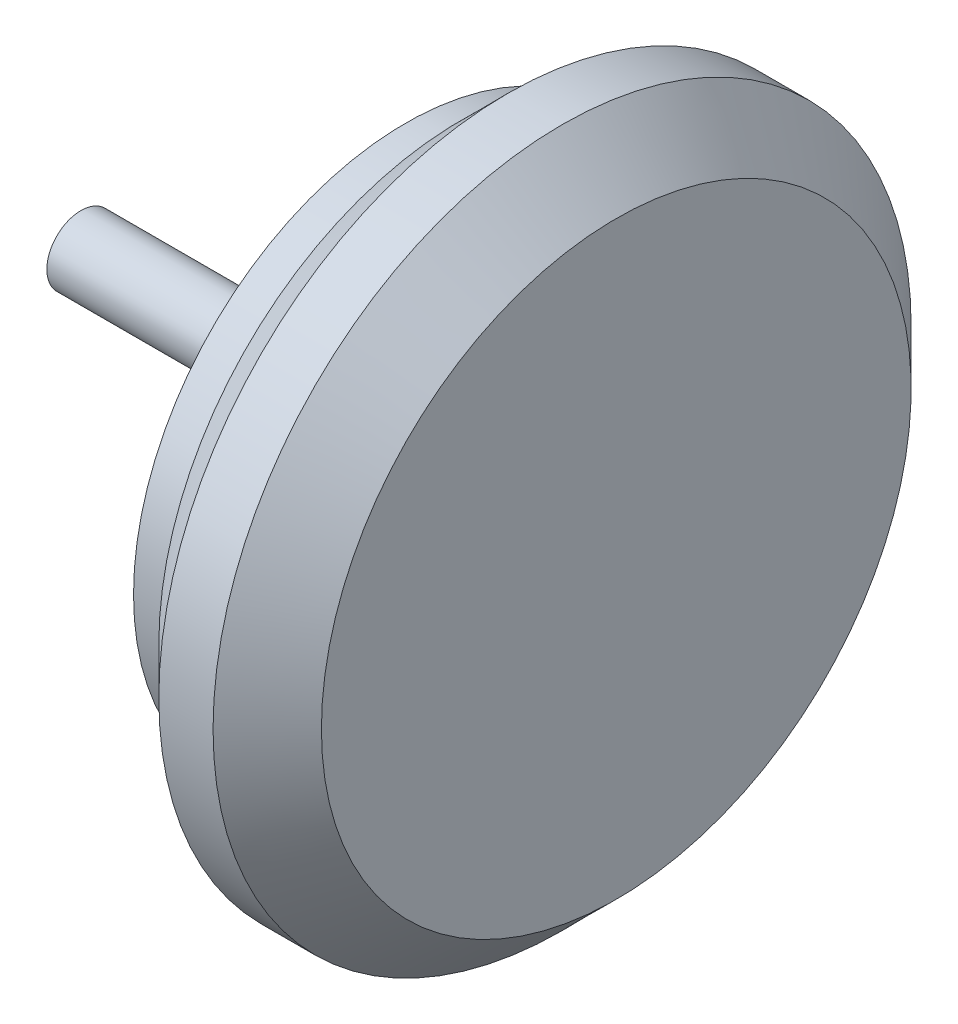
ISO-10303-21;
HEADER;
FILE_DESCRIPTION(('STEP AP214'),'2;1');
FILE_NAME('part.step','',(''),(''),'','','');
FILE_SCHEMA(('AUTOMOTIVE_DESIGN { 1 0 10303 214 1 1 1 1 }'));
ENDSEC;
DATA;
#1=APPLICATION_CONTEXT('core data for automotive mechanical design processes');
#2=APPLICATION_PROTOCOL_DEFINITION('international standard','automotive_design',2000,#1);
#3=PRODUCT_CONTEXT('',#1,'mechanical');
#4=PRODUCT('Part','Part','',(#3));
#5=PRODUCT_RELATED_PRODUCT_CATEGORY('part','',(#4));
#6=PRODUCT_DEFINITION_FORMATION('','',#4);
#7=PRODUCT_DEFINITION_CONTEXT('part definition',#1,'design');
#8=PRODUCT_DEFINITION('design','',#6,#7);
#9=PRODUCT_DEFINITION_SHAPE('','',#8);
#10=(LENGTH_UNIT() NAMED_UNIT(*) SI_UNIT(.MILLI.,.METRE.));
#11=(NAMED_UNIT(*) PLANE_ANGLE_UNIT() SI_UNIT($,.RADIAN.));
#12=(NAMED_UNIT(*) SI_UNIT($,.STERADIAN.) SOLID_ANGLE_UNIT());
#13=UNCERTAINTY_MEASURE_WITH_UNIT(LENGTH_MEASURE(1.E-05),#10,'distance_accuracy_value','');
#14=(GEOMETRIC_REPRESENTATION_CONTEXT(3) GLOBAL_UNCERTAINTY_ASSIGNED_CONTEXT((#13)) GLOBAL_UNIT_ASSIGNED_CONTEXT((#10,
#11,#12)) REPRESENTATION_CONTEXT('',''));
#15=CARTESIAN_POINT('',(0.,0.,0.));
#16=DIRECTION('',(0.,0.,1.));
#17=DIRECTION('',(1.,0.,0.));
#18=AXIS2_PLACEMENT_3D('',#15,#16,#17);
#19=CARTESIAN_POINT('',(545.433807632168,42.9999999999999,0.));
#20=DIRECTION('',(1.,0.,0.));
#21=DIRECTION('',(0.,0.,-1.));
#22=AXIS2_PLACEMENT_3D('',#19,#20,#21);
#23=PLANE('',#22);
#24=CARTESIAN_POINT('',(545.433807632168,42.,0.));
#25=DIRECTION('',(-1.,0.,0.));
#26=DIRECTION('',(0.,0.,1.));
#27=AXIS2_PLACEMENT_3D('',#24,#25,#26);
#28=CIRCLE('',#27,1.99999999999994);
#29=CARTESIAN_POINT('',(545.433807632168,42.,1.99999999999994));
#30=VERTEX_POINT('',#29);
#31=EDGE_CURVE('E18',#30,#30,#28,.F.);
#32=ORIENTED_EDGE('',*,*,#31,.F.);
#33=EDGE_LOOP('',(#32));
#34=FACE_BOUND('',#33,.T.);
#35=ADVANCED_FACE('F15',(#34),#23,.F.);
#36=CARTESIAN_POINT('',(547.433807632168,42.,0.));
#37=DIRECTION('',(-1.,0.,0.));
#38=DIRECTION('',(0.,0.,1.));
#39=AXIS2_PLACEMENT_3D('',#36,#37,#38);
#40=CYLINDRICAL_SURFACE('',#39,1.99999999999994);
#41=ORIENTED_EDGE('',*,*,#31,.T.);
#42=EDGE_LOOP('',(#41));
#43=FACE_BOUND('',#42,.T.);
#44=CARTESIAN_POINT('',(558.528319281076,42.,0.));
#45=DIRECTION('',(-1.,0.,0.));
#46=DIRECTION('',(0.,0.,1.));
#47=AXIS2_PLACEMENT_3D('',#44,#45,#46);
#48=CIRCLE('',#47,1.99999999999994);
#49=CARTESIAN_POINT('',(558.528319281076,42.,1.99999999999994));
#50=VERTEX_POINT('',#49);
#51=EDGE_CURVE('E57',#50,#50,#48,.F.);
#52=ORIENTED_EDGE('',*,*,#51,.F.);
#53=EDGE_LOOP('',(#52));
#54=FACE_BOUND('',#53,.T.);
#55=ADVANCED_FACE('F64',(#43,#54),#40,.T.);
#56=CARTESIAN_POINT('',(558.528319281076,45.0000000000001,0.));
#57=DIRECTION('',(-1.,0.,0.));
#58=DIRECTION('',(0.,0.,1.));
#59=AXIS2_PLACEMENT_3D('',#56,#57,#58);
#60=PLANE('',#59);
#61=ORIENTED_EDGE('',*,*,#51,.T.);
#62=EDGE_LOOP('',(#61));
#63=FACE_BOUND('',#62,.T.);
#64=CARTESIAN_POINT('',(558.528319281076,42.,0.));
#65=DIRECTION('',(1.,0.,0.));
#66=DIRECTION('',(0.,0.,-1.));
#67=AXIS2_PLACEMENT_3D('',#64,#65,#66);
#68=CIRCLE('',#67,4.00000000000006);
#69=CARTESIAN_POINT('',(558.528319281076,42.,-4.00000000000006));
#70=VERTEX_POINT('',#69);
#71=EDGE_CURVE('E55',#70,#70,#68,.T.);
#72=ORIENTED_EDGE('',*,*,#71,.F.);
#73=EDGE_LOOP('',(#72));
#74=FACE_BOUND('',#73,.T.);
#75=ADVANCED_FACE('F72',(#63,#74),#60,.T.);
#76=CARTESIAN_POINT('',(564.528319281076,42.,0.));
#77=DIRECTION('',(1.,0.,0.));
#78=DIRECTION('',(0.,0.,-1.));
#79=AXIS2_PLACEMENT_3D('',#76,#77,#78);
#80=CONICAL_SURFACE('',#79,7.00000000000006,0.463647609000806);
#81=CARTESIAN_POINT('',(564.528319281076,42.,0.));
#82=DIRECTION('',(1.,0.,0.));
#83=DIRECTION('',(0.,0.,-1.));
#84=AXIS2_PLACEMENT_3D('',#81,#82,#83);
#85=CIRCLE('',#84,7.00000000000006);
#86=CARTESIAN_POINT('',(564.528319281076,42.,-7.00000000000006));
#87=VERTEX_POINT('',#86);
#88=EDGE_CURVE('E52',#87,#87,#85,.T.);
#89=ORIENTED_EDGE('',*,*,#88,.F.);
#90=EDGE_LOOP('',(#89));
#91=FACE_BOUND('',#90,.T.);
#92=ORIENTED_EDGE('',*,*,#71,.T.);
#93=EDGE_LOOP('',(#92));
#94=FACE_BOUND('',#93,.T.);
#95=ADVANCED_FACE('F118',(#91,#94),#80,.T.);
#96=CARTESIAN_POINT('',(564.528319281076,51.0000000000001,0.));
#97=DIRECTION('',(-1.,0.,0.));
#98=DIRECTION('',(0.,0.,1.));
#99=AXIS2_PLACEMENT_3D('',#96,#97,#98);
#100=PLANE('',#99);
#101=ORIENTED_EDGE('',*,*,#88,.T.);
#102=EDGE_LOOP('',(#101));
#103=FACE_BOUND('',#102,.T.);
#104=CARTESIAN_POINT('',(564.528319281076,42.,0.));
#105=DIRECTION('',(-1.,0.,0.));
#106=DIRECTION('',(0.,0.,1.));
#107=AXIS2_PLACEMENT_3D('',#104,#105,#106);
#108=CIRCLE('',#107,11.0000000000001);
#109=CARTESIAN_POINT('',(564.528319281076,42.,11.0000000000001));
#110=VERTEX_POINT('',#109);
#111=EDGE_CURVE('E49',#110,#110,#108,.F.);
#112=ORIENTED_EDGE('',*,*,#111,.F.);
#113=EDGE_LOOP('',(#112));
#114=FACE_BOUND('',#113,.T.);
#115=ADVANCED_FACE('F114',(#103,#114),#100,.T.);
#116=CARTESIAN_POINT('',(568.028319281076,42.,0.));
#117=DIRECTION('',(-1.,0.,0.));
#118=DIRECTION('',(0.,0.,1.));
#119=AXIS2_PLACEMENT_3D('',#116,#117,#118);
#120=CYLINDRICAL_SURFACE('',#119,11.0000000000001);
#121=ORIENTED_EDGE('',*,*,#111,.T.);
#122=EDGE_LOOP('',(#121));
#123=FACE_BOUND('',#122,.T.);
#124=CARTESIAN_POINT('',(571.528319281076,42.,0.));
#125=DIRECTION('',(-1.,0.,0.));
#126=DIRECTION('',(0.,0.,1.));
#127=AXIS2_PLACEMENT_3D('',#124,#125,#126);
#128=CIRCLE('',#127,11.0000000000001);
#129=CARTESIAN_POINT('',(571.528319281076,42.,11.0000000000001));
#130=VERTEX_POINT('',#129);
#131=EDGE_CURVE('E46',#130,#130,#128,.F.);
#132=ORIENTED_EDGE('',*,*,#131,.F.);
#133=EDGE_LOOP('',(#132));
#134=FACE_BOUND('',#133,.T.);
#135=ADVANCED_FACE('F110',(#123,#134),#120,.T.);
#136=CARTESIAN_POINT('',(571.528319281076,54.5000000000001,0.));
#137=DIRECTION('',(-1.,0.,0.));
#138=DIRECTION('',(0.,0.,1.));
#139=AXIS2_PLACEMENT_3D('',#136,#137,#138);
#140=PLANE('',#139);
#141=ORIENTED_EDGE('',*,*,#131,.T.);
#142=EDGE_LOOP('',(#141));
#143=FACE_BOUND('',#142,.T.);
#144=CARTESIAN_POINT('',(571.528319281076,42.,0.));
#145=DIRECTION('',(-1.,0.,0.));
#146=DIRECTION('',(0.,0.,1.));
#147=AXIS2_PLACEMENT_3D('',#144,#145,#146);
#148=CIRCLE('',#147,14.0000000000001);
#149=CARTESIAN_POINT('',(571.528319281076,42.,14.0000000000001));
#150=VERTEX_POINT('',#149);
#151=EDGE_CURVE('E43',#150,#150,#148,.T.);
#152=ORIENTED_EDGE('',*,*,#151,.T.);
#153=EDGE_LOOP('',(#152));
#154=FACE_BOUND('',#153,.T.);
#155=ADVANCED_FACE('F106',(#143,#154),#140,.T.);
#156=CARTESIAN_POINT('',(568.028319281076,42.,0.));
#157=DIRECTION('',(-1.,0.,0.));
#158=DIRECTION('',(0.,0.,1.));
#159=AXIS2_PLACEMENT_3D('',#156,#157,#158);
#160=CYLINDRICAL_SURFACE('',#159,14.0000000000001);
#161=CARTESIAN_POINT('',(564.528319281076,42.,0.));
#162=DIRECTION('',(-1.,0.,0.));
#163=DIRECTION('',(0.,0.,1.));
#164=AXIS2_PLACEMENT_3D('',#161,#162,#163);
#165=CIRCLE('',#164,14.0000000000001);
#166=CARTESIAN_POINT('',(564.528319281076,42.,14.0000000000001));
#167=VERTEX_POINT('',#166);
#168=EDGE_CURVE('E40',#167,#167,#165,.F.);
#169=ORIENTED_EDGE('',*,*,#168,.F.);
#170=EDGE_LOOP('',(#169));
#171=FACE_BOUND('',#170,.T.);
#172=ORIENTED_EDGE('',*,*,#151,.F.);
#173=EDGE_LOOP('',(#172));
#174=FACE_BOUND('',#173,.T.);
#175=ADVANCED_FACE('F102',(#171,#174),#160,.F.);
#176=CARTESIAN_POINT('',(564.528319281076,57.0000000000001,0.));
#177=DIRECTION('',(-1.,0.,0.));
#178=DIRECTION('',(0.,0.,1.));
#179=AXIS2_PLACEMENT_3D('',#176,#177,#178);
#180=PLANE('',#179);
#181=ORIENTED_EDGE('',*,*,#168,.T.);
#182=EDGE_LOOP('',(#181));
#183=FACE_BOUND('',#182,.T.);
#184=CARTESIAN_POINT('',(564.528319281076,42.,0.));
#185=DIRECTION('',(-1.,0.,0.));
#186=DIRECTION('',(0.,0.,1.));
#187=AXIS2_PLACEMENT_3D('',#184,#185,#186);
#188=CIRCLE('',#187,16.0000000000001);
#189=CARTESIAN_POINT('',(564.528319281076,42.,16.0000000000001));
#190=VERTEX_POINT('',#189);
#191=EDGE_CURVE('E37',#190,#190,#188,.F.);
#192=ORIENTED_EDGE('',*,*,#191,.F.);
#193=EDGE_LOOP('',(#192));
#194=FACE_BOUND('',#193,.T.);
#195=ADVANCED_FACE('F98',(#183,#194),#180,.T.);
#196=CARTESIAN_POINT('',(566.166445422866,42.,0.));
#197=DIRECTION('',(-1.,0.,0.));
#198=DIRECTION('',(0.,0.,1.));
#199=AXIS2_PLACEMENT_3D('',#196,#197,#198);
#200=CYLINDRICAL_SURFACE('',#199,16.0000000000001);
#201=ORIENTED_EDGE('',*,*,#191,.T.);
#202=EDGE_LOOP('',(#201));
#203=FACE_BOUND('',#202,.T.);
#204=CARTESIAN_POINT('',(567.804571564655,42.,0.));
#205=DIRECTION('',(-1.,0.,0.));
#206=DIRECTION('',(0.,0.,1.));
#207=AXIS2_PLACEMENT_3D('',#204,#205,#206);
#208=CIRCLE('',#207,16.0000000000001);
#209=CARTESIAN_POINT('',(567.804571564655,42.,16.0000000000001));
#210=VERTEX_POINT('',#209);
#211=EDGE_CURVE('E34',#210,#210,#208,.T.);
#212=ORIENTED_EDGE('',*,*,#211,.T.);
#213=EDGE_LOOP('',(#212));
#214=FACE_BOUND('',#213,.T.);
#215=ADVANCED_FACE('F94',(#203,#214),#200,.T.);
#216=CARTESIAN_POINT('',(567.804571564655,58.8948515930712,0.));
#217=DIRECTION('',(1.,0.,0.));
#218=DIRECTION('',(0.,0.,-1.));
#219=AXIS2_PLACEMENT_3D('',#216,#217,#218);
#220=PLANE('',#219);
#221=ORIENTED_EDGE('',*,*,#211,.F.);
#222=EDGE_LOOP('',(#221));
#223=FACE_BOUND('',#222,.T.);
#224=CARTESIAN_POINT('',(567.804571564655,42.,0.));
#225=DIRECTION('',(1.,0.,0.));
#226=DIRECTION('',(0.,0.,-1.));
#227=AXIS2_PLACEMENT_3D('',#224,#225,#226);
#228=CIRCLE('',#227,17.7897031861423);
#229=CARTESIAN_POINT('',(567.804571564655,42.,-17.7897031861423));
#230=VERTEX_POINT('',#229);
#231=EDGE_CURVE('E31',#230,#230,#228,.T.);
#232=ORIENTED_EDGE('',*,*,#231,.F.);
#233=EDGE_LOOP('',(#232));
#234=FACE_BOUND('',#233,.T.);
#235=ADVANCED_FACE('F90',(#223,#234),#220,.F.);
#236=CARTESIAN_POINT('',(570.532852233428,42.,0.));
#237=DIRECTION('',(1.,0.,0.));
#238=DIRECTION('',(0.,0.,-1.));
#239=AXIS2_PLACEMENT_3D('',#236,#237,#238);
#240=CONICAL_SURFACE('',#239,20.5179838549154,0.785398163397448);
#241=ORIENTED_EDGE('',*,*,#231,.T.);
#242=EDGE_LOOP('',(#241));
#243=FACE_BOUND('',#242,.T.);
#244=CARTESIAN_POINT('',(570.532852233428,42.,0.));
#245=DIRECTION('',(-1.,0.,0.));
#246=DIRECTION('',(0.,0.,1.));
#247=AXIS2_PLACEMENT_3D('',#244,#245,#246);
#248=CIRCLE('',#247,20.5179838549154);
#249=CARTESIAN_POINT('',(570.532852233428,42.,20.5179838549154));
#250=VERTEX_POINT('',#249);
#251=EDGE_CURVE('E27',#250,#250,#248,.F.);
#252=ORIENTED_EDGE('',*,*,#251,.F.);
#253=EDGE_LOOP('',(#252));
#254=FACE_BOUND('',#253,.T.);
#255=ADVANCED_FACE('F86',(#243,#254),#240,.T.);
#256=CARTESIAN_POINT('',(572.126981788084,42.,0.));
#257=DIRECTION('',(-1.,0.,0.));
#258=DIRECTION('',(0.,0.,1.));
#259=AXIS2_PLACEMENT_3D('',#256,#257,#258);
#260=CYLINDRICAL_SURFACE('',#259,20.5179838549154);
#261=ORIENTED_EDGE('',*,*,#251,.T.);
#262=EDGE_LOOP('',(#261));
#263=FACE_BOUND('',#262,.T.);
#264=CARTESIAN_POINT('',(573.72111134274,42.,0.));
#265=DIRECTION('',(-1.,0.,0.));
#266=DIRECTION('',(0.,1.,0.));
#267=AXIS2_PLACEMENT_3D('',#264,#265,#266);
#268=CIRCLE('',#267,20.5179838549154);
#269=CARTESIAN_POINT('',(573.72111134274,62.5179838549154,0.));
#270=VERTEX_POINT('',#269);
#271=EDGE_CURVE('E22',#270,#270,#268,.F.);
#272=ORIENTED_EDGE('',*,*,#271,.F.);
#273=EDGE_LOOP('',(#272));
#274=FACE_BOUND('',#273,.T.);
#275=ADVANCED_FACE('F80',(#263,#274),#260,.T.);
#276=CARTESIAN_POINT('',(573.72111134274,42.,0.));
#277=DIRECTION('',(-1.,0.,0.));
#278=DIRECTION('',(0.,0.,1.));
#279=AXIS2_PLACEMENT_3D('',#276,#277,#278);
#280=CONICAL_SURFACE('',#279,20.5179838549154,0.785398163397447);
#281=CARTESIAN_POINT('',(576.905558656745,42.,0.));
#282=DIRECTION('',(-1.,0.,0.));
#283=DIRECTION('',(0.,0.,1.));
#284=AXIS2_PLACEMENT_3D('',#281,#282,#283);
#285=CIRCLE('',#284,17.3335365409103);
#286=CARTESIAN_POINT('',(576.905558656745,42.,17.3335365409103));
#287=VERTEX_POINT('',#286);
#288=EDGE_CURVE('E10',#287,#287,#285,.F.);
#289=ORIENTED_EDGE('',*,*,#288,.F.);
#290=EDGE_LOOP('',(#289));
#291=FACE_BOUND('',#290,.T.);
#292=ORIENTED_EDGE('',*,*,#271,.T.);
#293=EDGE_LOOP('',(#292));
#294=FACE_BOUND('',#293,.T.);
#295=ADVANCED_FACE('F75',(#291,#294),#280,.T.);
#296=CARTESIAN_POINT('',(576.905558656745,50.6667682704551,0.));
#297=DIRECTION('',(1.,0.,0.));
#298=DIRECTION('',(0.,0.,-1.));
#299=AXIS2_PLACEMENT_3D('',#296,#297,#298);
#300=PLANE('',#299);
#301=ORIENTED_EDGE('',*,*,#288,.T.);
#302=EDGE_LOOP('',(#301));
#303=FACE_BOUND('',#302,.T.);
#304=ADVANCED_FACE('F73',(#303),#300,.T.);
#305=CLOSED_SHELL('',(#35,#55,#75,#95,#115,#135,#155,#175,#195,#215,#235,#255,#275,#295,#304));
#306=MANIFOLD_SOLID_BREP('B1',#305);
#307=ADVANCED_BREP_SHAPE_REPRESENTATION('',(#18,#306),#14);
#308=SHAPE_DEFINITION_REPRESENTATION(#9,#307);
ENDSEC;
END-ISO-10303-21;
